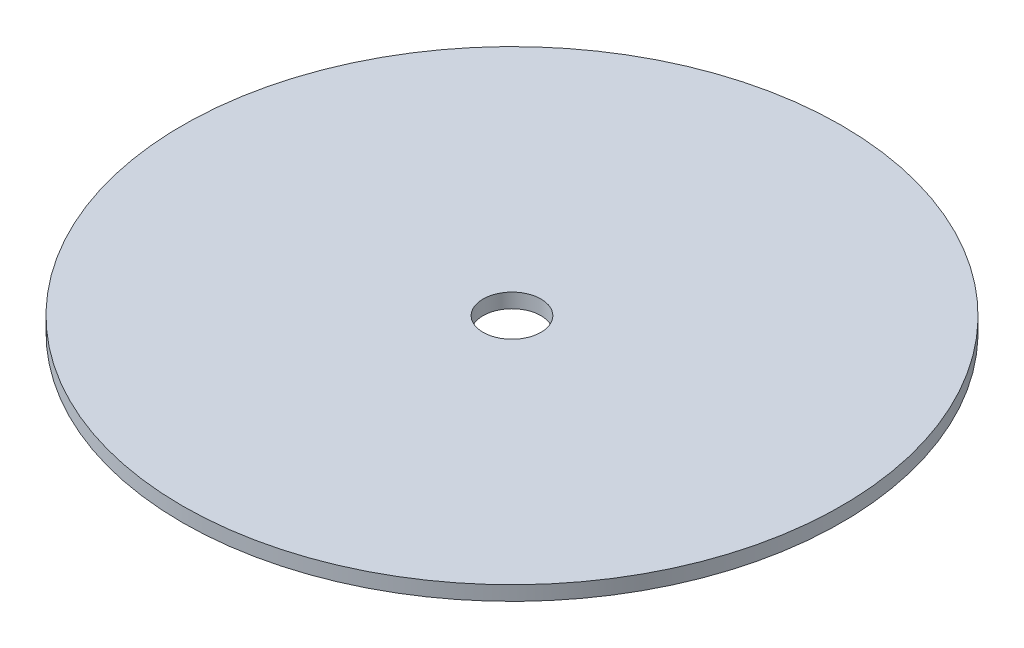
ISO-10303-21;
HEADER;
FILE_DESCRIPTION(('STEP AP214'),'2;1');
FILE_NAME('part.step','',(''),(''),'','','');
FILE_SCHEMA(('AUTOMOTIVE_DESIGN { 1 0 10303 214 1 1 1 1 }'));
ENDSEC;
DATA;
#1=APPLICATION_CONTEXT('core data for automotive mechanical design processes');
#2=APPLICATION_PROTOCOL_DEFINITION('international standard','automotive_design',2000,#1);
#3=PRODUCT_CONTEXT('',#1,'mechanical');
#4=PRODUCT('Part','Part','',(#3));
#5=PRODUCT_RELATED_PRODUCT_CATEGORY('part','',(#4));
#6=PRODUCT_DEFINITION_FORMATION('','',#4);
#7=PRODUCT_DEFINITION_CONTEXT('part definition',#1,'design');
#8=PRODUCT_DEFINITION('design','',#6,#7);
#9=PRODUCT_DEFINITION_SHAPE('','',#8);
#10=(LENGTH_UNIT() NAMED_UNIT(*) SI_UNIT(.MILLI.,.METRE.));
#11=(NAMED_UNIT(*) PLANE_ANGLE_UNIT() SI_UNIT($,.RADIAN.));
#12=(NAMED_UNIT(*) SI_UNIT($,.STERADIAN.) SOLID_ANGLE_UNIT());
#13=UNCERTAINTY_MEASURE_WITH_UNIT(LENGTH_MEASURE(1.E-05),#10,'distance_accuracy_value','');
#14=(GEOMETRIC_REPRESENTATION_CONTEXT(3) GLOBAL_UNCERTAINTY_ASSIGNED_CONTEXT((#13)) GLOBAL_UNIT_ASSIGNED_CONTEXT((#10,
#11,#12)) REPRESENTATION_CONTEXT('',''));
#15=CARTESIAN_POINT('',(0.,0.,0.));
#16=DIRECTION('',(0.,0.,1.));
#17=DIRECTION('',(1.,0.,0.));
#18=AXIS2_PLACEMENT_3D('',#15,#16,#17);
#19=CARTESIAN_POINT('',(0.,3.175,0.));
#20=DIRECTION('',(0.,-1.,0.));
#21=DIRECTION('',(0.,0.,-1.));
#22=AXIS2_PLACEMENT_3D('',#19,#20,#21);
#23=CYLINDRICAL_SURFACE('',#22,72.39);
#24=CARTESIAN_POINT('',(0.,3.175,0.));
#25=DIRECTION('',(0.,1.,0.));
#26=DIRECTION('',(0.,0.,1.));
#27=AXIS2_PLACEMENT_3D('',#24,#25,#26);
#28=CIRCLE('',#27,72.39);
#29=CARTESIAN_POINT('',(0.,3.175,72.39));
#30=VERTEX_POINT('',#29);
#31=EDGE_CURVE('E10',#30,#30,#28,.T.);
#32=ORIENTED_EDGE('',*,*,#31,.F.);
#33=EDGE_LOOP('',(#32));
#34=FACE_BOUND('',#33,.T.);
#35=CARTESIAN_POINT('',(0.,0.,0.));
#36=DIRECTION('',(0.,1.,0.));
#37=DIRECTION('',(0.,0.,1.));
#38=AXIS2_PLACEMENT_3D('',#35,#36,#37);
#39=CIRCLE('',#38,72.39);
#40=CARTESIAN_POINT('',(0.,0.,72.39));
#41=VERTEX_POINT('',#40);
#42=EDGE_CURVE('E34',#41,#41,#39,.T.);
#43=ORIENTED_EDGE('',*,*,#42,.T.);
#44=EDGE_LOOP('',(#43));
#45=FACE_BOUND('',#44,.T.);
#46=ADVANCED_FACE('F31',(#34,#45),#23,.T.);
#47=CARTESIAN_POINT('',(0.,3.175,0.));
#48=DIRECTION('',(0.,1.,0.));
#49=DIRECTION('',(0.,0.,1.));
#50=AXIS2_PLACEMENT_3D('',#47,#48,#49);
#51=PLANE('',#50);
#52=CARTESIAN_POINT('',(0.,3.175,0.));
#53=DIRECTION('',(0.,1.,0.));
#54=DIRECTION('',(0.,0.,1.));
#55=AXIS2_PLACEMENT_3D('',#52,#53,#54);
#56=CIRCLE('',#55,6.35);
#57=CARTESIAN_POINT('',(0.,3.175,6.35));
#58=VERTEX_POINT('',#57);
#59=EDGE_CURVE('E43',#58,#58,#56,.T.);
#60=ORIENTED_EDGE('',*,*,#59,.F.);
#61=EDGE_LOOP('',(#60));
#62=FACE_BOUND('',#61,.T.);
#63=ORIENTED_EDGE('',*,*,#31,.T.);
#64=EDGE_LOOP('',(#63));
#65=FACE_BOUND('',#64,.T.);
#66=ADVANCED_FACE('F58',(#62,#65),#51,.T.);
#67=CARTESIAN_POINT('',(0.,0.,0.));
#68=DIRECTION('',(0.,1.,0.));
#69=DIRECTION('',(0.,0.,1.));
#70=AXIS2_PLACEMENT_3D('',#67,#68,#69);
#71=PLANE('',#70);
#72=CARTESIAN_POINT('',(0.,0.,0.));
#73=DIRECTION('',(0.,1.,0.));
#74=DIRECTION('',(0.,0.,1.));
#75=AXIS2_PLACEMENT_3D('',#72,#73,#74);
#76=CIRCLE('',#75,6.35);
#77=CARTESIAN_POINT('',(0.,0.,6.35));
#78=VERTEX_POINT('',#77);
#79=EDGE_CURVE('E41',#78,#78,#76,.T.);
#80=ORIENTED_EDGE('',*,*,#79,.T.);
#81=EDGE_LOOP('',(#80));
#82=FACE_BOUND('',#81,.T.);
#83=ORIENTED_EDGE('',*,*,#42,.F.);
#84=EDGE_LOOP('',(#83));
#85=FACE_BOUND('',#84,.T.);
#86=ADVANCED_FACE('F49',(#82,#85),#71,.F.);
#87=CARTESIAN_POINT('',(0.,0.,0.));
#88=DIRECTION('',(0.,1.,0.));
#89=DIRECTION('',(0.,0.,1.));
#90=AXIS2_PLACEMENT_3D('',#87,#88,#89);
#91=CYLINDRICAL_SURFACE('',#90,6.35);
#92=ORIENTED_EDGE('',*,*,#79,.F.);
#93=EDGE_LOOP('',(#92));
#94=FACE_BOUND('',#93,.T.);
#95=ORIENTED_EDGE('',*,*,#59,.T.);
#96=EDGE_LOOP('',(#95));
#97=FACE_BOUND('',#96,.T.);
#98=ADVANCED_FACE('F52',(#94,#97),#91,.F.);
#99=CLOSED_SHELL('',(#46,#66,#86,#98));
#100=MANIFOLD_SOLID_BREP('B2',#99);
#101=ADVANCED_BREP_SHAPE_REPRESENTATION('',(#18,#100),#14);
#102=SHAPE_DEFINITION_REPRESENTATION(#9,#101);
ENDSEC;
END-ISO-10303-21;
